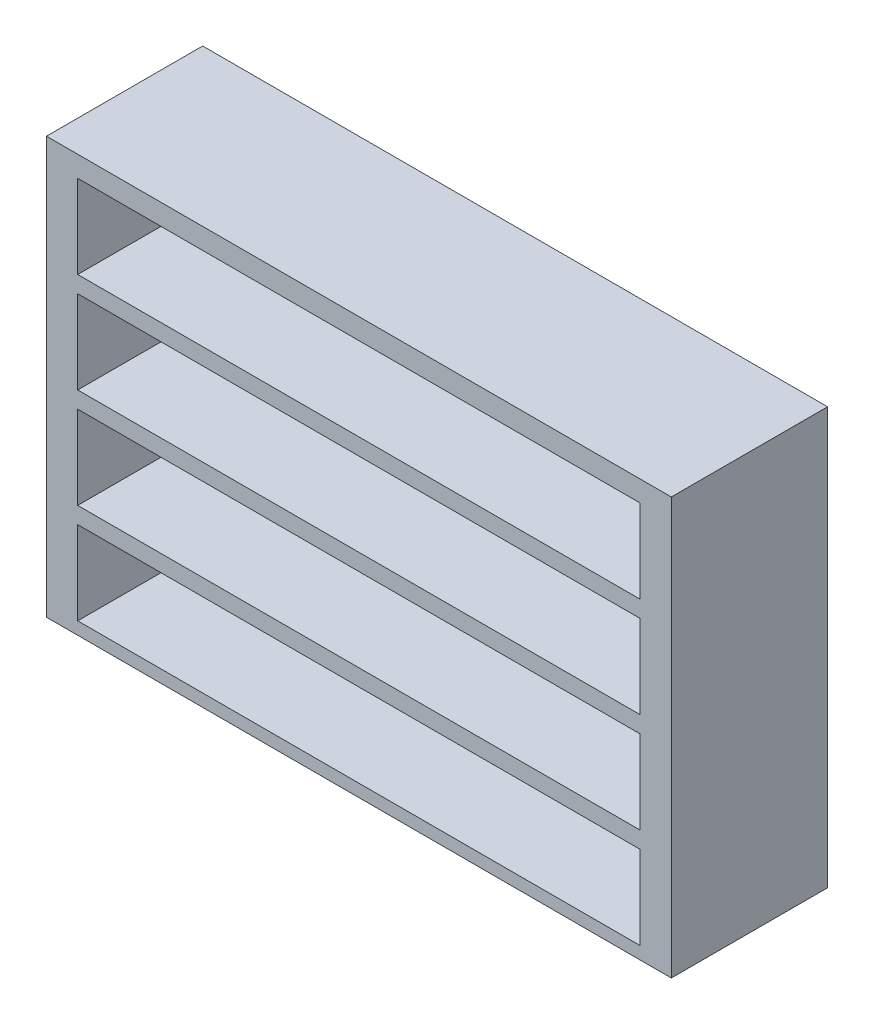
ISO-10303-21;
HEADER;
FILE_DESCRIPTION(('STEP AP214'),'2;1');
FILE_NAME('part.step','',(''),(''),'','','');
FILE_SCHEMA(('AUTOMOTIVE_DESIGN { 1 0 10303 214 1 1 1 1 }'));
ENDSEC;
DATA;
#1=APPLICATION_CONTEXT('core data for automotive mechanical design processes');
#2=APPLICATION_PROTOCOL_DEFINITION('international standard','automotive_design',2000,#1);
#3=PRODUCT_CONTEXT('',#1,'mechanical');
#4=PRODUCT('Part','Part','',(#3));
#5=PRODUCT_RELATED_PRODUCT_CATEGORY('part','',(#4));
#6=PRODUCT_DEFINITION_FORMATION('','',#4);
#7=PRODUCT_DEFINITION_CONTEXT('part definition',#1,'design');
#8=PRODUCT_DEFINITION('design','',#6,#7);
#9=PRODUCT_DEFINITION_SHAPE('','',#8);
#10=(LENGTH_UNIT() NAMED_UNIT(*) SI_UNIT(.MILLI.,.METRE.));
#11=(NAMED_UNIT(*) PLANE_ANGLE_UNIT() SI_UNIT($,.RADIAN.));
#12=(NAMED_UNIT(*) SI_UNIT($,.STERADIAN.) SOLID_ANGLE_UNIT());
#13=UNCERTAINTY_MEASURE_WITH_UNIT(LENGTH_MEASURE(1.E-05),#10,'distance_accuracy_value','');
#14=(GEOMETRIC_REPRESENTATION_CONTEXT(3) GLOBAL_UNCERTAINTY_ASSIGNED_CONTEXT((#13)) GLOBAL_UNIT_ASSIGNED_CONTEXT((#10,
#11,#12)) REPRESENTATION_CONTEXT('',''));
#15=CARTESIAN_POINT('',(0.,0.,0.));
#16=DIRECTION('',(0.,0.,1.));
#17=DIRECTION('',(1.,0.,0.));
#18=AXIS2_PLACEMENT_3D('',#15,#16,#17);
#19=CARTESIAN_POINT('',(0.,-1440.,25.));
#20=DIRECTION('',(0.,0.,1.));
#21=DIRECTION('',(1.,0.,0.));
#22=AXIS2_PLACEMENT_3D('',#19,#20,#21);
#23=PLANE('',#22);
#24=DIRECTION('',(0.,-1.,0.));
#25=VECTOR('',#24,1.);
#26=CARTESIAN_POINT('',(-1350.,-540.,25.));
#27=LINE('',#26,#25);
#28=CARTESIAN_POINT('',(-1350.,-540.,25.));
#29=VERTEX_POINT('',#28);
#30=CARTESIAN_POINT('',(-1350.,-940.,25.));
#31=VERTEX_POINT('',#30);
#32=EDGE_CURVE('E322',#29,#31,#27,.T.);
#33=ORIENTED_EDGE('',*,*,#32,.T.);
#34=DIRECTION('',(1.,0.,0.));
#35=VECTOR('',#34,1.);
#36=CARTESIAN_POINT('',(-1350.,-940.,25.));
#37=LINE('',#36,#35);
#38=CARTESIAN_POINT('',(1350.,-940.,25.));
#39=VERTEX_POINT('',#38);
#40=EDGE_CURVE('E11',#31,#39,#37,.T.);
#41=ORIENTED_EDGE('',*,*,#40,.T.);
#42=DIRECTION('',(0.,1.,0.));
#43=VECTOR('',#42,1.);
#44=CARTESIAN_POINT('',(1350.,-540.,25.));
#45=LINE('',#44,#43);
#46=CARTESIAN_POINT('',(1350.,-540.,25.));
#47=VERTEX_POINT('',#46);
#48=EDGE_CURVE('E47',#39,#47,#45,.T.);
#49=ORIENTED_EDGE('',*,*,#48,.T.);
#50=DIRECTION('',(-1.,0.,0.));
#51=VECTOR('',#50,1.);
#52=CARTESIAN_POINT('',(-1350.,-540.,25.));
#53=LINE('',#52,#51);
#54=EDGE_CURVE('E55',#47,#29,#53,.T.);
#55=ORIENTED_EDGE('',*,*,#54,.T.);
#56=EDGE_LOOP('',(#33,#41,#49,#55));
#57=FACE_BOUND('',#56,.T.);
#58=ADVANCED_FACE('F33',(#57),#23,.T.);
#59=CARTESIAN_POINT('',(-1350.,-940.,25.));
#60=DIRECTION('',(0.,-1.,0.));
#61=DIRECTION('',(0.,0.,-1.));
#62=AXIS2_PLACEMENT_3D('',#59,#60,#61);
#63=PLANE('',#62);
#64=DIRECTION('',(1.,0.,0.));
#65=VECTOR('',#64,1.);
#66=CARTESIAN_POINT('',(-1350.,-940.,750.));
#67=LINE('',#66,#65);
#68=CARTESIAN_POINT('',(-1350.,-940.,750.));
#69=VERTEX_POINT('',#68);
#70=CARTESIAN_POINT('',(1350.,-940.,750.));
#71=VERTEX_POINT('',#70);
#72=EDGE_CURVE('E316',#69,#71,#67,.T.);
#73=ORIENTED_EDGE('',*,*,#72,.T.);
#74=DIRECTION('',(0.,0.,1.));
#75=VECTOR('',#74,1.);
#76=CARTESIAN_POINT('',(1350.,-940.,25.));
#77=LINE('',#76,#75);
#78=EDGE_CURVE('E40',#39,#71,#77,.T.);
#79=ORIENTED_EDGE('',*,*,#78,.F.);
#80=ORIENTED_EDGE('',*,*,#40,.F.);
#81=DIRECTION('',(0.,0.,1.));
#82=VECTOR('',#81,1.);
#83=CARTESIAN_POINT('',(-1350.,-940.,25.));
#84=LINE('',#83,#82);
#85=EDGE_CURVE('E319',#31,#69,#84,.T.);
#86=ORIENTED_EDGE('',*,*,#85,.T.);
#87=EDGE_LOOP('',(#73,#79,#80,#86));
#88=FACE_BOUND('',#87,.T.);
#89=ADVANCED_FACE('F334',(#88),#63,.F.);
#90=CARTESIAN_POINT('',(1350.,-540.,25.));
#91=DIRECTION('',(1.,0.,0.));
#92=DIRECTION('',(0.,0.,-1.));
#93=AXIS2_PLACEMENT_3D('',#90,#91,#92);
#94=PLANE('',#93);
#95=DIRECTION('',(0.,1.,0.));
#96=VECTOR('',#95,1.);
#97=CARTESIAN_POINT('',(1350.,-540.,750.));
#98=LINE('',#97,#96);
#99=CARTESIAN_POINT('',(1350.,-540.,750.));
#100=VERTEX_POINT('',#99);
#101=EDGE_CURVE('E313',#71,#100,#98,.T.);
#102=ORIENTED_EDGE('',*,*,#101,.T.);
#103=DIRECTION('',(0.,0.,1.));
#104=VECTOR('',#103,1.);
#105=CARTESIAN_POINT('',(1350.,-540.,25.));
#106=LINE('',#105,#104);
#107=EDGE_CURVE('E329',#47,#100,#106,.T.);
#108=ORIENTED_EDGE('',*,*,#107,.F.);
#109=ORIENTED_EDGE('',*,*,#48,.F.);
#110=ORIENTED_EDGE('',*,*,#78,.T.);
#111=EDGE_LOOP('',(#102,#108,#109,#110));
#112=FACE_BOUND('',#111,.T.);
#113=ADVANCED_FACE('F331',(#112),#94,.F.);
#114=CARTESIAN_POINT('',(-1350.,-540.,25.));
#115=DIRECTION('',(0.,1.,0.));
#116=DIRECTION('',(0.,0.,1.));
#117=AXIS2_PLACEMENT_3D('',#114,#115,#116);
#118=PLANE('',#117);
#119=DIRECTION('',(-1.,0.,0.));
#120=VECTOR('',#119,1.);
#121=CARTESIAN_POINT('',(-1350.,-540.,750.));
#122=LINE('',#121,#120);
#123=CARTESIAN_POINT('',(-1350.,-540.,750.));
#124=VERTEX_POINT('',#123);
#125=EDGE_CURVE('E310',#100,#124,#122,.T.);
#126=ORIENTED_EDGE('',*,*,#125,.T.);
#127=DIRECTION('',(0.,0.,1.));
#128=VECTOR('',#127,1.);
#129=CARTESIAN_POINT('',(-1350.,-540.,25.));
#130=LINE('',#129,#128);
#131=EDGE_CURVE('E325',#29,#124,#130,.T.);
#132=ORIENTED_EDGE('',*,*,#131,.F.);
#133=ORIENTED_EDGE('',*,*,#54,.F.);
#134=ORIENTED_EDGE('',*,*,#107,.T.);
#135=EDGE_LOOP('',(#126,#132,#133,#134));
#136=FACE_BOUND('',#135,.T.);
#137=ADVANCED_FACE('F339',(#136),#118,.F.);
#138=CARTESIAN_POINT('',(-1350.,-540.,25.));
#139=DIRECTION('',(-1.,0.,0.));
#140=DIRECTION('',(0.,0.,1.));
#141=AXIS2_PLACEMENT_3D('',#138,#139,#140);
#142=PLANE('',#141);
#143=DIRECTION('',(0.,-1.,0.));
#144=VECTOR('',#143,1.);
#145=CARTESIAN_POINT('',(-1350.,-540.,750.));
#146=LINE('',#145,#144);
#147=EDGE_CURVE('E308',#124,#69,#146,.T.);
#148=ORIENTED_EDGE('',*,*,#147,.T.);
#149=ORIENTED_EDGE('',*,*,#85,.F.);
#150=ORIENTED_EDGE('',*,*,#32,.F.);
#151=ORIENTED_EDGE('',*,*,#131,.T.);
#152=EDGE_LOOP('',(#148,#149,#150,#151));
#153=FACE_BOUND('',#152,.T.);
#154=ADVANCED_FACE('F338',(#153),#142,.F.);
#155=CARTESIAN_POINT('',(0.,-960.,25.));
#156=DIRECTION('',(0.,0.,1.));
#157=DIRECTION('',(1.,0.,0.));
#158=AXIS2_PLACEMENT_3D('',#155,#156,#157);
#159=PLANE('',#158);
#160=DIRECTION('',(0.,-1.,0.));
#161=VECTOR('',#160,1.);
#162=CARTESIAN_POINT('',(-1350.,-60.0000000000001,25.));
#163=LINE('',#162,#161);
#164=CARTESIAN_POINT('',(-1350.,-60.0000000000001,25.));
#165=VERTEX_POINT('',#164);
#166=CARTESIAN_POINT('',(-1350.,-460.,25.));
#167=VERTEX_POINT('',#166);
#168=EDGE_CURVE('E287',#165,#167,#163,.T.);
#169=ORIENTED_EDGE('',*,*,#168,.T.);
#170=DIRECTION('',(1.,0.,0.));
#171=VECTOR('',#170,1.);
#172=CARTESIAN_POINT('',(-1350.,-460.,25.));
#173=LINE('',#172,#171);
#174=CARTESIAN_POINT('',(1350.,-460.,25.));
#175=VERTEX_POINT('',#174);
#176=EDGE_CURVE('E305',#167,#175,#173,.T.);
#177=ORIENTED_EDGE('',*,*,#176,.T.);
#178=DIRECTION('',(0.,1.,0.));
#179=VECTOR('',#178,1.);
#180=CARTESIAN_POINT('',(1350.,-60.0000000000001,25.));
#181=LINE('',#180,#179);
#182=CARTESIAN_POINT('',(1350.,-60.0000000000001,25.));
#183=VERTEX_POINT('',#182);
#184=EDGE_CURVE('E299',#175,#183,#181,.T.);
#185=ORIENTED_EDGE('',*,*,#184,.T.);
#186=DIRECTION('',(-1.,0.,0.));
#187=VECTOR('',#186,1.);
#188=CARTESIAN_POINT('',(-1350.,-60.0000000000001,25.));
#189=LINE('',#188,#187);
#190=EDGE_CURVE('E293',#183,#165,#189,.T.);
#191=ORIENTED_EDGE('',*,*,#190,.T.);
#192=EDGE_LOOP('',(#169,#177,#185,#191));
#193=FACE_BOUND('',#192,.T.);
#194=ADVANCED_FACE('F372',(#193),#159,.T.);
#195=CARTESIAN_POINT('',(-1350.,-460.,25.));
#196=DIRECTION('',(0.,-1.,0.));
#197=DIRECTION('',(0.,0.,-1.));
#198=AXIS2_PLACEMENT_3D('',#195,#196,#197);
#199=PLANE('',#198);
#200=DIRECTION('',(1.,0.,0.));
#201=VECTOR('',#200,1.);
#202=CARTESIAN_POINT('',(-1350.,-460.,750.));
#203=LINE('',#202,#201);
#204=CARTESIAN_POINT('',(-1350.,-460.,750.));
#205=VERTEX_POINT('',#204);
#206=CARTESIAN_POINT('',(1350.,-460.,750.));
#207=VERTEX_POINT('',#206);
#208=EDGE_CURVE('E281',#205,#207,#203,.T.);
#209=ORIENTED_EDGE('',*,*,#208,.T.);
#210=DIRECTION('',(0.,0.,1.));
#211=VECTOR('',#210,1.);
#212=CARTESIAN_POINT('',(1350.,-460.,25.));
#213=LINE('',#212,#211);
#214=EDGE_CURVE('E302',#175,#207,#213,.T.);
#215=ORIENTED_EDGE('',*,*,#214,.F.);
#216=ORIENTED_EDGE('',*,*,#176,.F.);
#217=DIRECTION('',(0.,0.,1.));
#218=VECTOR('',#217,1.);
#219=CARTESIAN_POINT('',(-1350.,-460.,25.));
#220=LINE('',#219,#218);
#221=EDGE_CURVE('E284',#167,#205,#220,.T.);
#222=ORIENTED_EDGE('',*,*,#221,.T.);
#223=EDGE_LOOP('',(#209,#215,#216,#222));
#224=FACE_BOUND('',#223,.T.);
#225=ADVANCED_FACE('F375',(#224),#199,.F.);
#226=CARTESIAN_POINT('',(1350.,-60.0000000000001,25.));
#227=DIRECTION('',(1.,0.,0.));
#228=DIRECTION('',(0.,0.,-1.));
#229=AXIS2_PLACEMENT_3D('',#226,#227,#228);
#230=PLANE('',#229);
#231=DIRECTION('',(0.,1.,0.));
#232=VECTOR('',#231,1.);
#233=CARTESIAN_POINT('',(1350.,-60.0000000000001,750.));
#234=LINE('',#233,#232);
#235=CARTESIAN_POINT('',(1350.,-60.0000000000001,750.));
#236=VERTEX_POINT('',#235);
#237=EDGE_CURVE('E278',#207,#236,#234,.T.);
#238=ORIENTED_EDGE('',*,*,#237,.T.);
#239=DIRECTION('',(0.,0.,1.));
#240=VECTOR('',#239,1.);
#241=CARTESIAN_POINT('',(1350.,-60.0000000000001,25.));
#242=LINE('',#241,#240);
#243=EDGE_CURVE('E296',#183,#236,#242,.T.);
#244=ORIENTED_EDGE('',*,*,#243,.F.);
#245=ORIENTED_EDGE('',*,*,#184,.F.);
#246=ORIENTED_EDGE('',*,*,#214,.T.);
#247=EDGE_LOOP('',(#238,#244,#245,#246));
#248=FACE_BOUND('',#247,.T.);
#249=ADVANCED_FACE('F379',(#248),#230,.F.);
#250=CARTESIAN_POINT('',(-1350.,-60.0000000000001,25.));
#251=DIRECTION('',(0.,1.,0.));
#252=DIRECTION('',(0.,0.,1.));
#253=AXIS2_PLACEMENT_3D('',#250,#251,#252);
#254=PLANE('',#253);
#255=DIRECTION('',(-1.,0.,0.));
#256=VECTOR('',#255,1.);
#257=CARTESIAN_POINT('',(-1350.,-60.0000000000001,750.));
#258=LINE('',#257,#256);
#259=CARTESIAN_POINT('',(-1350.,-60.0000000000001,750.));
#260=VERTEX_POINT('',#259);
#261=EDGE_CURVE('E275',#236,#260,#258,.T.);
#262=ORIENTED_EDGE('',*,*,#261,.T.);
#263=DIRECTION('',(0.,0.,1.));
#264=VECTOR('',#263,1.);
#265=CARTESIAN_POINT('',(-1350.,-60.0000000000001,25.));
#266=LINE('',#265,#264);
#267=EDGE_CURVE('E290',#165,#260,#266,.T.);
#268=ORIENTED_EDGE('',*,*,#267,.F.);
#269=ORIENTED_EDGE('',*,*,#190,.F.);
#270=ORIENTED_EDGE('',*,*,#243,.T.);
#271=EDGE_LOOP('',(#262,#268,#269,#270));
#272=FACE_BOUND('',#271,.T.);
#273=ADVANCED_FACE('F383',(#272),#254,.F.);
#274=CARTESIAN_POINT('',(-1350.,-60.0000000000001,25.));
#275=DIRECTION('',(-1.,0.,0.));
#276=DIRECTION('',(0.,0.,1.));
#277=AXIS2_PLACEMENT_3D('',#274,#275,#276);
#278=PLANE('',#277);
#279=DIRECTION('',(0.,-1.,0.));
#280=VECTOR('',#279,1.);
#281=CARTESIAN_POINT('',(-1350.,-60.0000000000001,750.));
#282=LINE('',#281,#280);
#283=EDGE_CURVE('E273',#260,#205,#282,.T.);
#284=ORIENTED_EDGE('',*,*,#283,.T.);
#285=ORIENTED_EDGE('',*,*,#221,.F.);
#286=ORIENTED_EDGE('',*,*,#168,.F.);
#287=ORIENTED_EDGE('',*,*,#267,.T.);
#288=EDGE_LOOP('',(#284,#285,#286,#287));
#289=FACE_BOUND('',#288,.T.);
#290=ADVANCED_FACE('F387',(#289),#278,.F.);
#291=CARTESIAN_POINT('',(1500.,-1000.,750.));
#292=DIRECTION('',(-1.,0.,0.));
#293=DIRECTION('',(0.,0.,1.));
#294=AXIS2_PLACEMENT_3D('',#291,#292,#293);
#295=PLANE('',#294);
#296=DIRECTION('',(0.,1.,0.));
#297=VECTOR('',#296,1.);
#298=CARTESIAN_POINT('',(1500.,-1000.,0.));
#299=LINE('',#298,#297);
#300=CARTESIAN_POINT('',(1500.,-1000.,0.));
#301=VERTEX_POINT('',#300);
#302=CARTESIAN_POINT('',(1500.,1000.,0.));
#303=VERTEX_POINT('',#302);
#304=EDGE_CURVE('E237',#301,#303,#299,.T.);
#305=ORIENTED_EDGE('',*,*,#304,.T.);
#306=DIRECTION('',(0.,0.,-1.));
#307=VECTOR('',#306,1.);
#308=CARTESIAN_POINT('',(1500.,1000.,750.));
#309=LINE('',#308,#307);
#310=CARTESIAN_POINT('',(1500.,1000.,750.));
#311=VERTEX_POINT('',#310);
#312=EDGE_CURVE('E270',#311,#303,#309,.T.);
#313=ORIENTED_EDGE('',*,*,#312,.F.);
#314=DIRECTION('',(0.,1.,0.));
#315=VECTOR('',#314,1.);
#316=CARTESIAN_POINT('',(1500.,-1000.,750.));
#317=LINE('',#316,#315);
#318=CARTESIAN_POINT('',(1500.,-1000.,750.));
#319=VERTEX_POINT('',#318);
#320=EDGE_CURVE('E244',#319,#311,#317,.T.);
#321=ORIENTED_EDGE('',*,*,#320,.F.);
#322=DIRECTION('',(0.,0.,-1.));
#323=VECTOR('',#322,1.);
#324=CARTESIAN_POINT('',(1500.,-1000.,750.));
#325=LINE('',#324,#323);
#326=EDGE_CURVE('E254',#319,#301,#325,.T.);
#327=ORIENTED_EDGE('',*,*,#326,.T.);
#328=EDGE_LOOP('',(#305,#313,#321,#327));
#329=FACE_BOUND('',#328,.T.);
#330=ADVANCED_FACE('F391',(#329),#295,.F.);
#331=CARTESIAN_POINT('',(-1500.,1000.,750.));
#332=DIRECTION('',(0.,-1.,0.));
#333=DIRECTION('',(0.,0.,-1.));
#334=AXIS2_PLACEMENT_3D('',#331,#332,#333);
#335=PLANE('',#334);
#336=DIRECTION('',(-1.,0.,0.));
#337=VECTOR('',#336,1.);
#338=CARTESIAN_POINT('',(-1500.,1000.,0.));
#339=LINE('',#338,#337);
#340=CARTESIAN_POINT('',(-1500.,1000.,0.));
#341=VERTEX_POINT('',#340);
#342=EDGE_CURVE('E257',#303,#341,#339,.T.);
#343=ORIENTED_EDGE('',*,*,#342,.T.);
#344=DIRECTION('',(0.,0.,-1.));
#345=VECTOR('',#344,1.);
#346=CARTESIAN_POINT('',(-1500.,1000.,750.));
#347=LINE('',#346,#345);
#348=CARTESIAN_POINT('',(-1500.,1000.,750.));
#349=VERTEX_POINT('',#348);
#350=EDGE_CURVE('E267',#349,#341,#347,.T.);
#351=ORIENTED_EDGE('',*,*,#350,.F.);
#352=DIRECTION('',(-1.,0.,0.));
#353=VECTOR('',#352,1.);
#354=CARTESIAN_POINT('',(-1500.,1000.,750.));
#355=LINE('',#354,#353);
#356=EDGE_CURVE('E247',#311,#349,#355,.T.);
#357=ORIENTED_EDGE('',*,*,#356,.F.);
#358=ORIENTED_EDGE('',*,*,#312,.T.);
#359=EDGE_LOOP('',(#343,#351,#357,#358));
#360=FACE_BOUND('',#359,.T.);
#361=ADVANCED_FACE('F395',(#360),#335,.F.);
#362=CARTESIAN_POINT('',(-1500.,-1000.,750.));
#363=DIRECTION('',(1.,0.,0.));
#364=DIRECTION('',(0.,0.,-1.));
#365=AXIS2_PLACEMENT_3D('',#362,#363,#364);
#366=PLANE('',#365);
#367=DIRECTION('',(0.,-1.,0.));
#368=VECTOR('',#367,1.);
#369=CARTESIAN_POINT('',(-1500.,-1000.,0.));
#370=LINE('',#369,#368);
#371=CARTESIAN_POINT('',(-1500.,-1000.,0.));
#372=VERTEX_POINT('',#371);
#373=EDGE_CURVE('E259',#341,#372,#370,.T.);
#374=ORIENTED_EDGE('',*,*,#373,.T.);
#375=DIRECTION('',(0.,0.,-1.));
#376=VECTOR('',#375,1.);
#377=CARTESIAN_POINT('',(-1500.,-1000.,750.));
#378=LINE('',#377,#376);
#379=CARTESIAN_POINT('',(-1500.,-1000.,750.));
#380=VERTEX_POINT('',#379);
#381=EDGE_CURVE('E264',#380,#372,#378,.T.);
#382=ORIENTED_EDGE('',*,*,#381,.F.);
#383=DIRECTION('',(0.,-1.,0.));
#384=VECTOR('',#383,1.);
#385=CARTESIAN_POINT('',(-1500.,-1000.,750.));
#386=LINE('',#385,#384);
#387=EDGE_CURVE('E250',#349,#380,#386,.T.);
#388=ORIENTED_EDGE('',*,*,#387,.F.);
#389=ORIENTED_EDGE('',*,*,#350,.T.);
#390=EDGE_LOOP('',(#374,#382,#388,#389));
#391=FACE_BOUND('',#390,.T.);
#392=ADVANCED_FACE('F354',(#391),#366,.F.);
#393=CARTESIAN_POINT('',(-1500.,-1000.,750.));
#394=DIRECTION('',(0.,1.,0.));
#395=DIRECTION('',(0.,0.,1.));
#396=AXIS2_PLACEMENT_3D('',#393,#394,#395);
#397=PLANE('',#396);
#398=DIRECTION('',(1.,0.,0.));
#399=VECTOR('',#398,1.);
#400=CARTESIAN_POINT('',(-1500.,-1000.,0.));
#401=LINE('',#400,#399);
#402=EDGE_CURVE('E248',#372,#301,#401,.T.);
#403=ORIENTED_EDGE('',*,*,#402,.T.);
#404=ORIENTED_EDGE('',*,*,#326,.F.);
#405=DIRECTION('',(1.,0.,0.));
#406=VECTOR('',#405,1.);
#407=CARTESIAN_POINT('',(-1500.,-1000.,750.));
#408=LINE('',#407,#406);
#409=EDGE_CURVE('E252',#380,#319,#408,.T.);
#410=ORIENTED_EDGE('',*,*,#409,.F.);
#411=ORIENTED_EDGE('',*,*,#381,.T.);
#412=EDGE_LOOP('',(#403,#404,#410,#411));
#413=FACE_BOUND('',#412,.T.);
#414=ADVANCED_FACE('F344',(#413),#397,.F.);
#415=CARTESIAN_POINT('',(0.,0.,750.));
#416=DIRECTION('',(0.,0.,-1.));
#417=DIRECTION('',(-1.,0.,0.));
#418=AXIS2_PLACEMENT_3D('',#415,#416,#417);
#419=PLANE('',#418);
#420=DIRECTION('',(1.,0.,0.));
#421=VECTOR('',#420,1.);
#422=CARTESIAN_POINT('',(-1350.,19.9999999999999,750.));
#423=LINE('',#422,#421);
#424=CARTESIAN_POINT('',(-1350.,19.9999999999999,750.));
#425=VERTEX_POINT('',#424);
#426=CARTESIAN_POINT('',(1350.,19.9999999999999,750.));
#427=VERTEX_POINT('',#426);
#428=EDGE_CURVE('E182',#425,#427,#423,.T.);
#429=ORIENTED_EDGE('',*,*,#428,.F.);
#430=DIRECTION('',(0.,-1.,0.));
#431=VECTOR('',#430,1.);
#432=CARTESIAN_POINT('',(-1350.,420.,750.));
#433=LINE('',#432,#431);
#434=CARTESIAN_POINT('',(-1350.,420.,750.));
#435=VERTEX_POINT('',#434);
#436=EDGE_CURVE('E196',#435,#425,#433,.T.);
#437=ORIENTED_EDGE('',*,*,#436,.F.);
#438=DIRECTION('',(-1.,0.,0.));
#439=VECTOR('',#438,1.);
#440=CARTESIAN_POINT('',(-1350.,420.,750.));
#441=LINE('',#440,#439);
#442=CARTESIAN_POINT('',(1350.,420.,750.));
#443=VERTEX_POINT('',#442);
#444=EDGE_CURVE('E206',#443,#435,#441,.T.);
#445=ORIENTED_EDGE('',*,*,#444,.F.);
#446=DIRECTION('',(0.,1.,0.));
#447=VECTOR('',#446,1.);
#448=CARTESIAN_POINT('',(1350.,420.,750.));
#449=LINE('',#448,#447);
#450=EDGE_CURVE('E197',#427,#443,#449,.T.);
#451=ORIENTED_EDGE('',*,*,#450,.F.);
#452=EDGE_LOOP('',(#429,#437,#445,#451));
#453=FACE_BOUND('',#452,.T.);
#454=DIRECTION('',(1.,0.,0.));
#455=VECTOR('',#454,1.);
#456=CARTESIAN_POINT('',(-1350.,500.,750.));
#457=LINE('',#456,#455);
#458=CARTESIAN_POINT('',(-1350.,500.,750.));
#459=VERTEX_POINT('',#458);
#460=CARTESIAN_POINT('',(1350.,500.,750.));
#461=VERTEX_POINT('',#460);
#462=EDGE_CURVE('E227',#459,#461,#457,.T.);
#463=ORIENTED_EDGE('',*,*,#462,.F.);
#464=DIRECTION('',(0.,-1.,0.));
#465=VECTOR('',#464,1.);
#466=CARTESIAN_POINT('',(-1350.,900.,750.));
#467=LINE('',#466,#465);
#468=CARTESIAN_POINT('',(-1350.,900.,750.));
#469=VERTEX_POINT('',#468);
#470=EDGE_CURVE('E211',#469,#459,#467,.T.);
#471=ORIENTED_EDGE('',*,*,#470,.F.);
#472=DIRECTION('',(-1.,0.,0.));
#473=VECTOR('',#472,1.);
#474=CARTESIAN_POINT('',(-1350.,900.,750.));
#475=LINE('',#474,#473);
#476=CARTESIAN_POINT('',(1350.,900.,750.));
#477=VERTEX_POINT('',#476);
#478=EDGE_CURVE('E216',#477,#469,#475,.T.);
#479=ORIENTED_EDGE('',*,*,#478,.F.);
#480=DIRECTION('',(0.,1.,0.));
#481=VECTOR('',#480,1.);
#482=CARTESIAN_POINT('',(1350.,900.,750.));
#483=LINE('',#482,#481);
#484=EDGE_CURVE('E230',#461,#477,#483,.T.);
#485=ORIENTED_EDGE('',*,*,#484,.F.);
#486=EDGE_LOOP('',(#463,#471,#479,#485));
#487=FACE_BOUND('',#486,.T.);
#488=ORIENTED_EDGE('',*,*,#320,.T.);
#489=ORIENTED_EDGE('',*,*,#356,.T.);
#490=ORIENTED_EDGE('',*,*,#387,.T.);
#491=ORIENTED_EDGE('',*,*,#409,.T.);
#492=EDGE_LOOP('',(#488,#489,#490,#491));
#493=FACE_BOUND('',#492,.T.);
#494=ORIENTED_EDGE('',*,*,#283,.F.);
#495=ORIENTED_EDGE('',*,*,#261,.F.);
#496=ORIENTED_EDGE('',*,*,#237,.F.);
#497=ORIENTED_EDGE('',*,*,#208,.F.);
#498=EDGE_LOOP('',(#494,#495,#496,#497));
#499=FACE_BOUND('',#498,.T.);
#500=ORIENTED_EDGE('',*,*,#147,.F.);
#501=ORIENTED_EDGE('',*,*,#125,.F.);
#502=ORIENTED_EDGE('',*,*,#101,.F.);
#503=ORIENTED_EDGE('',*,*,#72,.F.);
#504=EDGE_LOOP('',(#500,#501,#502,#503));
#505=FACE_BOUND('',#504,.T.);
#506=ADVANCED_FACE('F341',(#453,#487,#493,#499,#505),#419,.F.);
#507=CARTESIAN_POINT('',(0.,0.,0.));
#508=DIRECTION('',(0.,0.,-1.));
#509=DIRECTION('',(-1.,0.,0.));
#510=AXIS2_PLACEMENT_3D('',#507,#508,#509);
#511=PLANE('',#510);
#512=ORIENTED_EDGE('',*,*,#304,.F.);
#513=ORIENTED_EDGE('',*,*,#402,.F.);
#514=ORIENTED_EDGE('',*,*,#373,.F.);
#515=ORIENTED_EDGE('',*,*,#342,.F.);
#516=EDGE_LOOP('',(#512,#513,#514,#515));
#517=FACE_BOUND('',#516,.T.);
#518=ADVANCED_FACE('F343',(#517),#511,.T.);
#519=CARTESIAN_POINT('',(-1350.,900.,25.));
#520=DIRECTION('',(-1.,0.,0.));
#521=DIRECTION('',(0.,0.,1.));
#522=AXIS2_PLACEMENT_3D('',#519,#520,#521);
#523=PLANE('',#522);
#524=ORIENTED_EDGE('',*,*,#470,.T.);
#525=DIRECTION('',(0.,0.,1.));
#526=VECTOR('',#525,1.);
#527=CARTESIAN_POINT('',(-1350.,500.,25.));
#528=LINE('',#527,#526);
#529=CARTESIAN_POINT('',(-1350.,500.,25.));
#530=VERTEX_POINT('',#529);
#531=EDGE_CURVE('E225',#530,#459,#528,.T.);
#532=ORIENTED_EDGE('',*,*,#531,.F.);
#533=DIRECTION('',(0.,-1.,0.));
#534=VECTOR('',#533,1.);
#535=CARTESIAN_POINT('',(-1350.,900.,25.));
#536=LINE('',#535,#534);
#537=CARTESIAN_POINT('',(-1350.,900.,25.));
#538=VERTEX_POINT('',#537);
#539=EDGE_CURVE('E212',#538,#530,#536,.T.);
#540=ORIENTED_EDGE('',*,*,#539,.F.);
#541=DIRECTION('',(0.,0.,1.));
#542=VECTOR('',#541,1.);
#543=CARTESIAN_POINT('',(-1350.,900.,25.));
#544=LINE('',#543,#542);
#545=EDGE_CURVE('E235',#538,#469,#544,.T.);
#546=ORIENTED_EDGE('',*,*,#545,.T.);
#547=EDGE_LOOP('',(#524,#532,#540,#546));
#548=FACE_BOUND('',#547,.T.);
#549=ADVANCED_FACE('F351',(#548),#523,.F.);
#550=CARTESIAN_POINT('',(-1350.,900.,25.));
#551=DIRECTION('',(0.,1.,0.));
#552=DIRECTION('',(0.,0.,1.));
#553=AXIS2_PLACEMENT_3D('',#550,#551,#552);
#554=PLANE('',#553);
#555=ORIENTED_EDGE('',*,*,#478,.T.);
#556=ORIENTED_EDGE('',*,*,#545,.F.);
#557=DIRECTION('',(-1.,0.,0.));
#558=VECTOR('',#557,1.);
#559=CARTESIAN_POINT('',(-1350.,900.,25.));
#560=LINE('',#559,#558);
#561=CARTESIAN_POINT('',(1350.,900.,25.));
#562=VERTEX_POINT('',#561);
#563=EDGE_CURVE('E222',#562,#538,#560,.T.);
#564=ORIENTED_EDGE('',*,*,#563,.F.);
#565=DIRECTION('',(0.,0.,1.));
#566=VECTOR('',#565,1.);
#567=CARTESIAN_POINT('',(1350.,900.,25.));
#568=LINE('',#567,#566);
#569=EDGE_CURVE('E238',#562,#477,#568,.T.);
#570=ORIENTED_EDGE('',*,*,#569,.T.);
#571=EDGE_LOOP('',(#555,#556,#564,#570));
#572=FACE_BOUND('',#571,.T.);
#573=ADVANCED_FACE('F443',(#572),#554,.F.);
#574=CARTESIAN_POINT('',(1350.,900.,25.));
#575=DIRECTION('',(1.,0.,0.));
#576=DIRECTION('',(0.,0.,-1.));
#577=AXIS2_PLACEMENT_3D('',#574,#575,#576);
#578=PLANE('',#577);
#579=ORIENTED_EDGE('',*,*,#484,.T.);
#580=ORIENTED_EDGE('',*,*,#569,.F.);
#581=DIRECTION('',(0.,1.,0.));
#582=VECTOR('',#581,1.);
#583=CARTESIAN_POINT('',(1350.,900.,25.));
#584=LINE('',#583,#582);
#585=CARTESIAN_POINT('',(1350.,500.,25.));
#586=VERTEX_POINT('',#585);
#587=EDGE_CURVE('E219',#586,#562,#584,.T.);
#588=ORIENTED_EDGE('',*,*,#587,.F.);
#589=DIRECTION('',(0.,0.,1.));
#590=VECTOR('',#589,1.);
#591=CARTESIAN_POINT('',(1350.,500.,25.));
#592=LINE('',#591,#590);
#593=EDGE_CURVE('E240',#586,#461,#592,.T.);
#594=ORIENTED_EDGE('',*,*,#593,.T.);
#595=EDGE_LOOP('',(#579,#580,#588,#594));
#596=FACE_BOUND('',#595,.T.);
#597=ADVANCED_FACE('F452',(#596),#578,.F.);
#598=CARTESIAN_POINT('',(-1350.,500.,25.));
#599=DIRECTION('',(0.,-1.,0.));
#600=DIRECTION('',(0.,0.,-1.));
#601=AXIS2_PLACEMENT_3D('',#598,#599,#600);
#602=PLANE('',#601);
#603=ORIENTED_EDGE('',*,*,#462,.T.);
#604=ORIENTED_EDGE('',*,*,#593,.F.);
#605=DIRECTION('',(1.,0.,0.));
#606=VECTOR('',#605,1.);
#607=CARTESIAN_POINT('',(-1350.,500.,25.));
#608=LINE('',#607,#606);
#609=EDGE_CURVE('E215',#530,#586,#608,.T.);
#610=ORIENTED_EDGE('',*,*,#609,.F.);
#611=ORIENTED_EDGE('',*,*,#531,.T.);
#612=EDGE_LOOP('',(#603,#604,#610,#611));
#613=FACE_BOUND('',#612,.T.);
#614=ADVANCED_FACE('F462',(#613),#602,.F.);
#615=CARTESIAN_POINT('',(0.,0.,25.));
#616=DIRECTION('',(0.,0.,1.));
#617=DIRECTION('',(1.,0.,0.));
#618=AXIS2_PLACEMENT_3D('',#615,#616,#617);
#619=PLANE('',#618);
#620=ORIENTED_EDGE('',*,*,#539,.T.);
#621=ORIENTED_EDGE('',*,*,#609,.T.);
#622=ORIENTED_EDGE('',*,*,#587,.T.);
#623=ORIENTED_EDGE('',*,*,#563,.T.);
#624=EDGE_LOOP('',(#620,#621,#622,#623));
#625=FACE_BOUND('',#624,.T.);
#626=ADVANCED_FACE('F472',(#625),#619,.T.);
#627=CARTESIAN_POINT('',(-1350.,420.,25.));
#628=DIRECTION('',(-1.,0.,0.));
#629=DIRECTION('',(0.,0.,1.));
#630=AXIS2_PLACEMENT_3D('',#627,#628,#629);
#631=PLANE('',#630);
#632=ORIENTED_EDGE('',*,*,#436,.T.);
#633=DIRECTION('',(0.,0.,1.));
#634=VECTOR('',#633,1.);
#635=CARTESIAN_POINT('',(-1350.,19.9999999999999,25.));
#636=LINE('',#635,#634);
#637=CARTESIAN_POINT('',(-1350.,19.9999999999999,25.));
#638=VERTEX_POINT('',#637);
#639=EDGE_CURVE('E188',#638,#425,#636,.T.);
#640=ORIENTED_EDGE('',*,*,#639,.F.);
#641=DIRECTION('',(0.,-1.,0.));
#642=VECTOR('',#641,1.);
#643=CARTESIAN_POINT('',(-1350.,420.,25.));
#644=LINE('',#643,#642);
#645=CARTESIAN_POINT('',(-1350.,420.,25.));
#646=VERTEX_POINT('',#645);
#647=EDGE_CURVE('E171',#646,#638,#644,.T.);
#648=ORIENTED_EDGE('',*,*,#647,.F.);
#649=DIRECTION('',(0.,0.,1.));
#650=VECTOR('',#649,1.);
#651=CARTESIAN_POINT('',(-1350.,420.,25.));
#652=LINE('',#651,#650);
#653=EDGE_CURVE('E208',#646,#435,#652,.T.);
#654=ORIENTED_EDGE('',*,*,#653,.T.);
#655=EDGE_LOOP('',(#632,#640,#648,#654));
#656=FACE_BOUND('',#655,.T.);
#657=ADVANCED_FACE('F194',(#656),#631,.F.);
#658=CARTESIAN_POINT('',(-1350.,420.,25.));
#659=DIRECTION('',(0.,1.,0.));
#660=DIRECTION('',(0.,0.,1.));
#661=AXIS2_PLACEMENT_3D('',#658,#659,#660);
#662=PLANE('',#661);
#663=ORIENTED_EDGE('',*,*,#444,.T.);
#664=ORIENTED_EDGE('',*,*,#653,.F.);
#665=DIRECTION('',(-1.,0.,0.));
#666=VECTOR('',#665,1.);
#667=CARTESIAN_POINT('',(-1350.,420.,25.));
#668=LINE('',#667,#666);
#669=CARTESIAN_POINT('',(1350.,420.,25.));
#670=VERTEX_POINT('',#669);
#671=EDGE_CURVE('E177',#670,#646,#668,.T.);
#672=ORIENTED_EDGE('',*,*,#671,.F.);
#673=DIRECTION('',(0.,0.,1.));
#674=VECTOR('',#673,1.);
#675=CARTESIAN_POINT('',(1350.,420.,25.));
#676=LINE('',#675,#674);
#677=EDGE_CURVE('E199',#670,#443,#676,.T.);
#678=ORIENTED_EDGE('',*,*,#677,.T.);
#679=EDGE_LOOP('',(#663,#664,#672,#678));
#680=FACE_BOUND('',#679,.T.);
#681=ADVANCED_FACE('F550',(#680),#662,.F.);
#682=CARTESIAN_POINT('',(1350.,420.,25.));
#683=DIRECTION('',(1.,0.,0.));
#684=DIRECTION('',(0.,0.,-1.));
#685=AXIS2_PLACEMENT_3D('',#682,#683,#684);
#686=PLANE('',#685);
#687=ORIENTED_EDGE('',*,*,#450,.T.);
#688=ORIENTED_EDGE('',*,*,#677,.F.);
#689=DIRECTION('',(0.,1.,0.));
#690=VECTOR('',#689,1.);
#691=CARTESIAN_POINT('',(1350.,420.,25.));
#692=LINE('',#691,#690);
#693=CARTESIAN_POINT('',(1350.,19.9999999999999,25.));
#694=VERTEX_POINT('',#693);
#695=EDGE_CURVE('E192',#694,#670,#692,.T.);
#696=ORIENTED_EDGE('',*,*,#695,.F.);
#697=DIRECTION('',(0.,0.,1.));
#698=VECTOR('',#697,1.);
#699=CARTESIAN_POINT('',(1350.,19.9999999999999,25.));
#700=LINE('',#699,#698);
#701=EDGE_CURVE('E191',#694,#427,#700,.T.);
#702=ORIENTED_EDGE('',*,*,#701,.T.);
#703=EDGE_LOOP('',(#687,#688,#696,#702));
#704=FACE_BOUND('',#703,.T.);
#705=ADVANCED_FACE('F559',(#704),#686,.F.);
#706=CARTESIAN_POINT('',(-1350.,19.9999999999999,25.));
#707=DIRECTION('',(0.,-1.,0.));
#708=DIRECTION('',(0.,0.,-1.));
#709=AXIS2_PLACEMENT_3D('',#706,#707,#708);
#710=PLANE('',#709);
#711=ORIENTED_EDGE('',*,*,#428,.T.);
#712=ORIENTED_EDGE('',*,*,#701,.F.);
#713=DIRECTION('',(1.,0.,0.));
#714=VECTOR('',#713,1.);
#715=CARTESIAN_POINT('',(-1350.,19.9999999999999,25.));
#716=LINE('',#715,#714);
#717=EDGE_CURVE('E174',#638,#694,#716,.T.);
#718=ORIENTED_EDGE('',*,*,#717,.F.);
#719=ORIENTED_EDGE('',*,*,#639,.T.);
#720=EDGE_LOOP('',(#711,#712,#718,#719));
#721=FACE_BOUND('',#720,.T.);
#722=ADVANCED_FACE('F187',(#721),#710,.F.);
#723=CARTESIAN_POINT('',(0.,-480.,25.));
#724=DIRECTION('',(0.,0.,1.));
#725=DIRECTION('',(1.,0.,0.));
#726=AXIS2_PLACEMENT_3D('',#723,#724,#725);
#727=PLANE('',#726);
#728=ORIENTED_EDGE('',*,*,#647,.T.);
#729=ORIENTED_EDGE('',*,*,#717,.T.);
#730=ORIENTED_EDGE('',*,*,#695,.T.);
#731=ORIENTED_EDGE('',*,*,#671,.T.);
#732=EDGE_LOOP('',(#728,#729,#730,#731));
#733=FACE_BOUND('',#732,.T.);
#734=ADVANCED_FACE('F173',(#733),#727,.T.);
#735=CLOSED_SHELL('',(#58,#89,#113,#137,#154,#194,#225,#249,#273,#290,#330,#361,#392,#414,#506,
#518,#549,#573,#597,#614,#626,#657,#681,#705,#722,#734));
#736=MANIFOLD_SOLID_BREP('B2',#735);
#737=ADVANCED_BREP_SHAPE_REPRESENTATION('',(#18,#736),#14);
#738=SHAPE_DEFINITION_REPRESENTATION(#9,#737);
ENDSEC;
END-ISO-10303-21;
